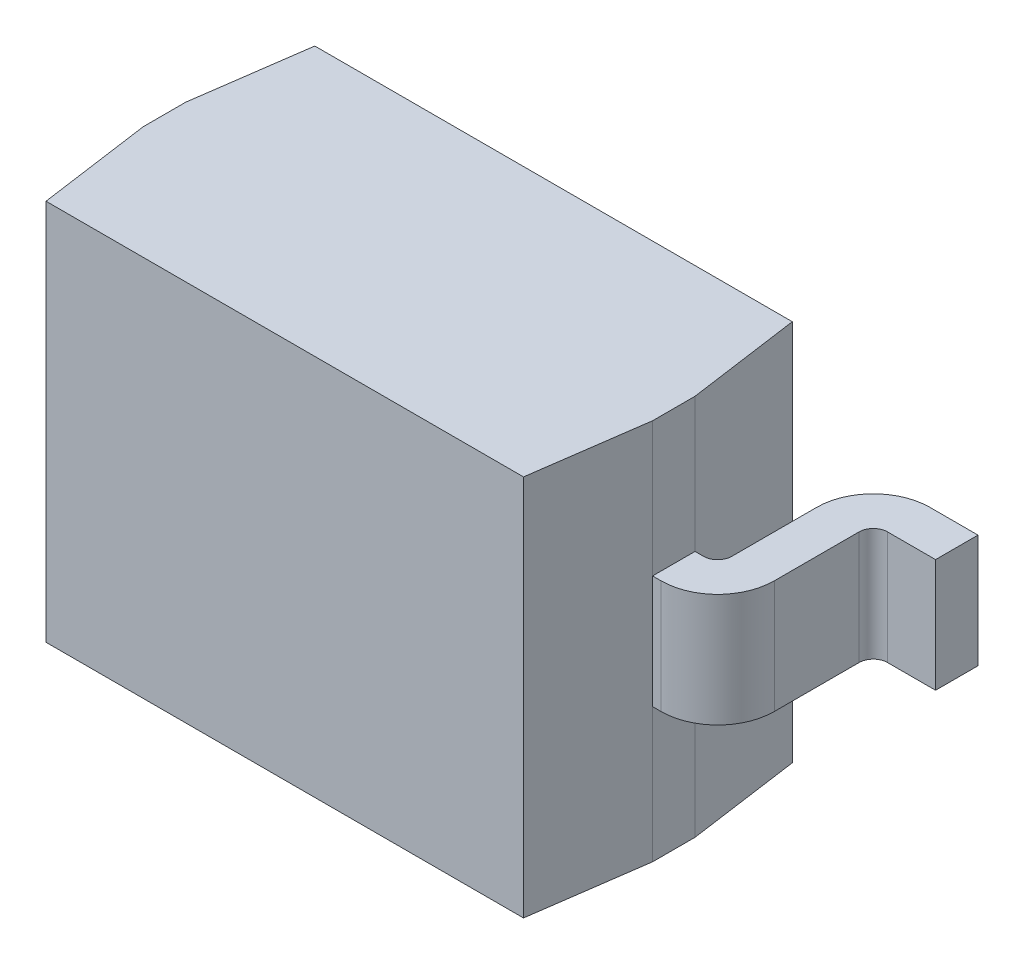
ISO-10303-21;
HEADER;
FILE_DESCRIPTION(('STEP AP214'),'2;1');
FILE_NAME('part.step','',(''),(''),'','','');
FILE_SCHEMA(('AUTOMOTIVE_DESIGN { 1 0 10303 214 1 1 1 1 }'));
ENDSEC;
DATA;
#1=APPLICATION_CONTEXT('core data for automotive mechanical design processes');
#2=APPLICATION_PROTOCOL_DEFINITION('international standard','automotive_design',2000,#1);
#3=PRODUCT_CONTEXT('',#1,'mechanical');
#4=PRODUCT('Part','Part','',(#3));
#5=PRODUCT_RELATED_PRODUCT_CATEGORY('part','',(#4));
#6=PRODUCT_DEFINITION_FORMATION('','',#4);
#7=PRODUCT_DEFINITION_CONTEXT('part definition',#1,'design');
#8=PRODUCT_DEFINITION('design','',#6,#7);
#9=PRODUCT_DEFINITION_SHAPE('','',#8);
#10=(LENGTH_UNIT() NAMED_UNIT(*) SI_UNIT(.MILLI.,.METRE.));
#11=(NAMED_UNIT(*) PLANE_ANGLE_UNIT() SI_UNIT($,.RADIAN.));
#12=(NAMED_UNIT(*) SI_UNIT($,.STERADIAN.) SOLID_ANGLE_UNIT());
#13=UNCERTAINTY_MEASURE_WITH_UNIT(LENGTH_MEASURE(1.E-05),#10,'distance_accuracy_value','');
#14=(GEOMETRIC_REPRESENTATION_CONTEXT(3) GLOBAL_UNCERTAINTY_ASSIGNED_CONTEXT((#13)) GLOBAL_UNIT_ASSIGNED_CONTEXT((#10,
#11,#12)) REPRESENTATION_CONTEXT('',''));
#15=CARTESIAN_POINT('',(0.,0.,0.));
#16=DIRECTION('',(0.,0.,1.));
#17=DIRECTION('',(1.,0.,0.));
#18=AXIS2_PLACEMENT_3D('',#15,#16,#17);
#19=CARTESIAN_POINT('',(0.871891833059522,0.,0.9));
#20=DIRECTION('',(0.99026806874157,0.,0.139173100960065));
#21=DIRECTION('',(0.,-1.,0.));
#22=AXIS2_PLACEMENT_3D('',#19,#20,#21);
#23=PLANE('',#22);
#24=DIRECTION('',(-0.139173100960065,0.,0.99026806874157));
#25=VECTOR('',#24,1.);
#26=CARTESIAN_POINT('',(0.882397998537451,0.675,0.825244748259981));
#27=LINE('',#26,#25);
#28=CARTESIAN_POINT('',(0.9,0.675,0.7));
#29=VERTEX_POINT('',#28);
#30=CARTESIAN_POINT('',(0.843783666119044,0.675,1.1));
#31=VERTEX_POINT('',#30);
#32=EDGE_CURVE('E27',#29,#31,#27,.T.);
#33=ORIENTED_EDGE('',*,*,#32,.T.);
#34=DIRECTION('',(0.,-1.,0.));
#35=VECTOR('',#34,1.);
#36=CARTESIAN_POINT('',(0.843783666119044,0.,1.1));
#37=LINE('',#36,#35);
#38=CARTESIAN_POINT('',(0.843783666119044,-0.675,1.1));
#39=VERTEX_POINT('',#38);
#40=EDGE_CURVE('E11',#31,#39,#37,.T.);
#41=ORIENTED_EDGE('',*,*,#40,.T.);
#42=DIRECTION('',(0.139173100960065,0.,-0.99026806874157));
#43=VECTOR('',#42,1.);
#44=CARTESIAN_POINT('',(0.882397998537451,-0.675,0.825244748259981));
#45=LINE('',#44,#43);
#46=CARTESIAN_POINT('',(0.9,-0.675,0.7));
#47=VERTEX_POINT('',#46);
#48=EDGE_CURVE('E509',#39,#47,#45,.T.);
#49=ORIENTED_EDGE('',*,*,#48,.T.);
#50=DIRECTION('',(0.,1.,0.));
#51=VECTOR('',#50,1.);
#52=CARTESIAN_POINT('',(0.9,0.,0.7));
#53=LINE('',#52,#51);
#54=CARTESIAN_POINT('',(0.9,-0.2,0.7));
#55=VERTEX_POINT('',#54);
#56=EDGE_CURVE('E318',#47,#55,#53,.T.);
#57=ORIENTED_EDGE('',*,*,#56,.T.);
#58=DIRECTION('',(0.,1.,0.));
#59=VECTOR('',#58,1.);
#60=CARTESIAN_POINT('',(0.9,0.,0.7));
#61=LINE('',#60,#59);
#62=CARTESIAN_POINT('',(0.9,0.2,0.7));
#63=VERTEX_POINT('',#62);
#64=EDGE_CURVE('E481',#55,#63,#61,.T.);
#65=ORIENTED_EDGE('',*,*,#64,.T.);
#66=DIRECTION('',(0.,1.,0.));
#67=VECTOR('',#66,1.);
#68=CARTESIAN_POINT('',(0.9,0.,0.7));
#69=LINE('',#68,#67);
#70=EDGE_CURVE('E307',#63,#29,#69,.T.);
#71=ORIENTED_EDGE('',*,*,#70,.T.);
#72=EDGE_LOOP('',(#33,#41,#49,#57,#65,#71));
#73=FACE_BOUND('',#72,.T.);
#74=ADVANCED_FACE('F16',(#73),#23,.T.);
#75=CARTESIAN_POINT('',(0.,0.,1.1));
#76=DIRECTION('',(0.,0.,-1.));
#77=DIRECTION('',(0.,-1.,0.));
#78=AXIS2_PLACEMENT_3D('',#75,#76,#77);
#79=PLANE('',#78);
#80=DIRECTION('',(0.,1.,0.));
#81=VECTOR('',#80,1.);
#82=CARTESIAN_POINT('',(-0.843783666119043,0.,1.1));
#83=LINE('',#82,#81);
#84=CARTESIAN_POINT('',(-0.843783666119043,-0.675,1.1));
#85=VERTEX_POINT('',#84);
#86=CARTESIAN_POINT('',(-0.843783666119043,0.675,1.1));
#87=VERTEX_POINT('',#86);
#88=EDGE_CURVE('E421',#85,#87,#83,.T.);
#89=ORIENTED_EDGE('',*,*,#88,.F.);
#90=DIRECTION('',(-1.,0.,0.));
#91=VECTOR('',#90,1.);
#92=CARTESIAN_POINT('',(0.,-0.675,1.1));
#93=LINE('',#92,#91);
#94=EDGE_CURVE('E433',#39,#85,#93,.T.);
#95=ORIENTED_EDGE('',*,*,#94,.F.);
#96=ORIENTED_EDGE('',*,*,#40,.F.);
#97=DIRECTION('',(1.,0.,0.));
#98=VECTOR('',#97,1.);
#99=CARTESIAN_POINT('',(0.,0.675,1.1));
#100=LINE('',#99,#98);
#101=EDGE_CURVE('E518',#87,#31,#100,.T.);
#102=ORIENTED_EDGE('',*,*,#101,.F.);
#103=EDGE_LOOP('',(#89,#95,#96,#102));
#104=FACE_BOUND('',#103,.T.);
#105=ADVANCED_FACE('F1050',(#104),#79,.F.);
#106=CARTESIAN_POINT('',(0.,0.675,0.625));
#107=DIRECTION('',(0.,-1.,0.));
#108=DIRECTION('',(-1.,0.,0.));
#109=AXIS2_PLACEMENT_3D('',#106,#107,#108);
#110=PLANE('',#109);
#111=DIRECTION('',(0.139173100960065,0.,-0.99026806874157));
#112=VECTOR('',#111,1.);
#113=CARTESIAN_POINT('',(-0.882397998537451,0.675,0.424755251740019));
#114=LINE('',#113,#112);
#115=CARTESIAN_POINT('',(-0.9,0.675,0.55));
#116=VERTEX_POINT('',#115);
#117=CARTESIAN_POINT('',(-0.843783666119043,0.675,0.15));
#118=VERTEX_POINT('',#117);
#119=EDGE_CURVE('E281',#116,#118,#114,.T.);
#120=ORIENTED_EDGE('',*,*,#119,.F.);
#121=DIRECTION('',(0.,0.,1.));
#122=VECTOR('',#121,1.);
#123=CARTESIAN_POINT('',(-0.9,0.675,0.625));
#124=LINE('',#123,#122);
#125=CARTESIAN_POINT('',(-0.9,0.675,0.7));
#126=VERTEX_POINT('',#125);
#127=EDGE_CURVE('E579',#116,#126,#124,.T.);
#128=ORIENTED_EDGE('',*,*,#127,.T.);
#129=DIRECTION('',(-0.139173100960065,0.,-0.99026806874157));
#130=VECTOR('',#129,1.);
#131=CARTESIAN_POINT('',(-0.882397998537451,0.675,0.825244748259981));
#132=LINE('',#131,#130);
#133=EDGE_CURVE('E418',#87,#126,#132,.T.);
#134=ORIENTED_EDGE('',*,*,#133,.F.);
#135=ORIENTED_EDGE('',*,*,#101,.T.);
#136=ORIENTED_EDGE('',*,*,#32,.F.);
#137=DIRECTION('',(0.,0.,-1.));
#138=VECTOR('',#137,1.);
#139=CARTESIAN_POINT('',(0.9,0.675,0.625));
#140=LINE('',#139,#138);
#141=CARTESIAN_POINT('',(0.9,0.675,0.55));
#142=VERTEX_POINT('',#141);
#143=EDGE_CURVE('E314',#29,#142,#140,.T.);
#144=ORIENTED_EDGE('',*,*,#143,.T.);
#145=DIRECTION('',(0.139173100960065,0.,0.99026806874157));
#146=VECTOR('',#145,1.);
#147=CARTESIAN_POINT('',(0.882397998537451,0.675,0.424755251740019));
#148=LINE('',#147,#146);
#149=CARTESIAN_POINT('',(0.843783666119044,0.675,0.15));
#150=VERTEX_POINT('',#149);
#151=EDGE_CURVE('E285',#150,#142,#148,.T.);
#152=ORIENTED_EDGE('',*,*,#151,.F.);
#153=DIRECTION('',(-1.,0.,0.));
#154=VECTOR('',#153,1.);
#155=CARTESIAN_POINT('',(0.,0.675,0.15));
#156=LINE('',#155,#154);
#157=EDGE_CURVE('E276',#150,#118,#156,.T.);
#158=ORIENTED_EDGE('',*,*,#157,.T.);
#159=EDGE_LOOP('',(#120,#128,#134,#135,#136,#144,#152,#158));
#160=FACE_BOUND('',#159,.T.);
#161=ADVANCED_FACE('F278',(#160),#110,.F.);
#162=CARTESIAN_POINT('',(-0.871891833059522,0.,0.9));
#163=DIRECTION('',(-0.99026806874157,0.,0.139173100960065));
#164=DIRECTION('',(0.,1.,0.));
#165=AXIS2_PLACEMENT_3D('',#162,#163,#164);
#166=PLANE('',#165);
#167=ORIENTED_EDGE('',*,*,#133,.T.);
#168=DIRECTION('',(0.,-1.,0.));
#169=VECTOR('',#168,1.);
#170=CARTESIAN_POINT('',(-0.9,0.,0.7));
#171=LINE('',#170,#169);
#172=CARTESIAN_POINT('',(-0.9,0.2,0.7));
#173=VERTEX_POINT('',#172);
#174=EDGE_CURVE('E576',#126,#173,#171,.T.);
#175=ORIENTED_EDGE('',*,*,#174,.T.);
#176=DIRECTION('',(0.,-1.,0.));
#177=VECTOR('',#176,1.);
#178=CARTESIAN_POINT('',(-0.9,0.,0.7));
#179=LINE('',#178,#177);
#180=CARTESIAN_POINT('',(-0.9,-0.2,0.7));
#181=VERTEX_POINT('',#180);
#182=EDGE_CURVE('E361',#173,#181,#179,.T.);
#183=ORIENTED_EDGE('',*,*,#182,.T.);
#184=DIRECTION('',(0.,-1.,0.));
#185=VECTOR('',#184,1.);
#186=CARTESIAN_POINT('',(-0.9,0.,0.7));
#187=LINE('',#186,#185);
#188=CARTESIAN_POINT('',(-0.9,-0.675,0.7));
#189=VERTEX_POINT('',#188);
#190=EDGE_CURVE('E339',#181,#189,#187,.T.);
#191=ORIENTED_EDGE('',*,*,#190,.T.);
#192=DIRECTION('',(0.139173100960065,0.,0.99026806874157));
#193=VECTOR('',#192,1.);
#194=CARTESIAN_POINT('',(-0.882397998537451,-0.675,0.825244748259982));
#195=LINE('',#194,#193);
#196=EDGE_CURVE('E290',#189,#85,#195,.T.);
#197=ORIENTED_EDGE('',*,*,#196,.T.);
#198=ORIENTED_EDGE('',*,*,#88,.T.);
#199=EDGE_LOOP('',(#167,#175,#183,#191,#197,#198));
#200=FACE_BOUND('',#199,.T.);
#201=ADVANCED_FACE('F1049',(#200),#166,.T.);
#202=CARTESIAN_POINT('',(0.871891833059522,0.,0.35));
#203=DIRECTION('',(0.99026806874157,0.,-0.139173100960065));
#204=DIRECTION('',(0.,-1.,0.));
#205=AXIS2_PLACEMENT_3D('',#202,#203,#204);
#206=PLANE('',#205);
#207=ORIENTED_EDGE('',*,*,#151,.T.);
#208=DIRECTION('',(0.,-1.,0.));
#209=VECTOR('',#208,1.);
#210=CARTESIAN_POINT('',(0.9,0.,0.55));
#211=LINE('',#210,#209);
#212=CARTESIAN_POINT('',(0.9,0.2,0.55));
#213=VERTEX_POINT('',#212);
#214=EDGE_CURVE('E438',#142,#213,#211,.T.);
#215=ORIENTED_EDGE('',*,*,#214,.T.);
#216=DIRECTION('',(0.,-1.,0.));
#217=VECTOR('',#216,1.);
#218=CARTESIAN_POINT('',(0.9,0.,0.55));
#219=LINE('',#218,#217);
#220=CARTESIAN_POINT('',(0.9,-0.2,0.55));
#221=VERTEX_POINT('',#220);
#222=EDGE_CURVE('E327',#213,#221,#219,.T.);
#223=ORIENTED_EDGE('',*,*,#222,.T.);
#224=DIRECTION('',(0.,-1.,0.));
#225=VECTOR('',#224,1.);
#226=CARTESIAN_POINT('',(0.9,0.,0.55));
#227=LINE('',#226,#225);
#228=CARTESIAN_POINT('',(0.9,-0.675,0.55));
#229=VERTEX_POINT('',#228);
#230=EDGE_CURVE('E441',#221,#229,#227,.T.);
#231=ORIENTED_EDGE('',*,*,#230,.T.);
#232=DIRECTION('',(-0.139173100960065,0.,-0.99026806874157));
#233=VECTOR('',#232,1.);
#234=CARTESIAN_POINT('',(0.882397998537451,-0.675,0.424755251740019));
#235=LINE('',#234,#233);
#236=CARTESIAN_POINT('',(0.843783666119044,-0.675,0.15));
#237=VERTEX_POINT('',#236);
#238=EDGE_CURVE('E443',#229,#237,#235,.T.);
#239=ORIENTED_EDGE('',*,*,#238,.T.);
#240=DIRECTION('',(0.,1.,0.));
#241=VECTOR('',#240,1.);
#242=CARTESIAN_POINT('',(0.843783666119044,0.,0.15));
#243=LINE('',#242,#241);
#244=EDGE_CURVE('E289',#237,#150,#243,.T.);
#245=ORIENTED_EDGE('',*,*,#244,.T.);
#246=EDGE_LOOP('',(#207,#215,#223,#231,#239,#245));
#247=FACE_BOUND('',#246,.T.);
#248=ADVANCED_FACE('F1108',(#247),#206,.T.);
#249=CARTESIAN_POINT('',(0.,0.,0.15));
#250=DIRECTION('',(0.,0.,1.));
#251=DIRECTION('',(0.,-1.,0.));
#252=AXIS2_PLACEMENT_3D('',#249,#250,#251);
#253=PLANE('',#252);
#254=DIRECTION('',(0.,-1.,0.));
#255=VECTOR('',#254,1.);
#256=CARTESIAN_POINT('',(-0.843783666119043,0.,0.15));
#257=LINE('',#256,#255);
#258=CARTESIAN_POINT('',(-0.843783666119043,-0.675,0.15));
#259=VERTEX_POINT('',#258);
#260=EDGE_CURVE('E293',#118,#259,#257,.T.);
#261=ORIENTED_EDGE('',*,*,#260,.F.);
#262=ORIENTED_EDGE('',*,*,#157,.F.);
#263=ORIENTED_EDGE('',*,*,#244,.F.);
#264=DIRECTION('',(1.,0.,0.));
#265=VECTOR('',#264,1.);
#266=CARTESIAN_POINT('',(0.,-0.675,0.15));
#267=LINE('',#266,#265);
#268=EDGE_CURVE('E296',#259,#237,#267,.T.);
#269=ORIENTED_EDGE('',*,*,#268,.F.);
#270=EDGE_LOOP('',(#261,#262,#263,#269));
#271=FACE_BOUND('',#270,.T.);
#272=ADVANCED_FACE('F294',(#271),#253,.F.);
#273=CARTESIAN_POINT('',(0.,-0.675,0.625));
#274=DIRECTION('',(0.,-1.,0.));
#275=DIRECTION('',(-1.,0.,0.));
#276=AXIS2_PLACEMENT_3D('',#273,#274,#275);
#277=PLANE('',#276);
#278=DIRECTION('',(-0.139173100960065,0.,0.99026806874157));
#279=VECTOR('',#278,1.);
#280=CARTESIAN_POINT('',(-0.882397998537451,-0.675,0.424755251740019));
#281=LINE('',#280,#279);
#282=CARTESIAN_POINT('',(-0.9,-0.675,0.55));
#283=VERTEX_POINT('',#282);
#284=EDGE_CURVE('E300',#259,#283,#281,.T.);
#285=ORIENTED_EDGE('',*,*,#284,.F.);
#286=ORIENTED_EDGE('',*,*,#268,.T.);
#287=ORIENTED_EDGE('',*,*,#238,.F.);
#288=DIRECTION('',(0.,0.,1.));
#289=VECTOR('',#288,1.);
#290=CARTESIAN_POINT('',(0.9,-0.675,0.625));
#291=LINE('',#290,#289);
#292=EDGE_CURVE('E493',#229,#47,#291,.T.);
#293=ORIENTED_EDGE('',*,*,#292,.T.);
#294=ORIENTED_EDGE('',*,*,#48,.F.);
#295=ORIENTED_EDGE('',*,*,#94,.T.);
#296=ORIENTED_EDGE('',*,*,#196,.F.);
#297=DIRECTION('',(0.,0.,-1.));
#298=VECTOR('',#297,1.);
#299=CARTESIAN_POINT('',(-0.9,-0.675,0.625));
#300=LINE('',#299,#298);
#301=EDGE_CURVE('E335',#189,#283,#300,.T.);
#302=ORIENTED_EDGE('',*,*,#301,.T.);
#303=EDGE_LOOP('',(#285,#286,#287,#293,#294,#295,#296,#302));
#304=FACE_BOUND('',#303,.T.);
#305=ADVANCED_FACE('F999',(#304),#277,.T.);
#306=CARTESIAN_POINT('',(-0.871891833059522,0.,0.35));
#307=DIRECTION('',(-0.99026806874157,0.,-0.139173100960065));
#308=DIRECTION('',(-0.139173100960065,0.,0.99026806874157));
#309=AXIS2_PLACEMENT_3D('',#306,#307,#308);
#310=PLANE('',#309);
#311=ORIENTED_EDGE('',*,*,#119,.T.);
#312=ORIENTED_EDGE('',*,*,#260,.T.);
#313=ORIENTED_EDGE('',*,*,#284,.T.);
#314=DIRECTION('',(0.,1.,0.));
#315=VECTOR('',#314,1.);
#316=CARTESIAN_POINT('',(-0.9,0.,0.55));
#317=LINE('',#316,#315);
#318=CARTESIAN_POINT('',(-0.9,-0.2,0.55));
#319=VERTEX_POINT('',#318);
#320=EDGE_CURVE('E340',#283,#319,#317,.T.);
#321=ORIENTED_EDGE('',*,*,#320,.T.);
#322=DIRECTION('',(0.,1.,0.));
#323=VECTOR('',#322,1.);
#324=CARTESIAN_POINT('',(-0.9,0.,0.55));
#325=LINE('',#324,#323);
#326=CARTESIAN_POINT('',(-0.9,0.2,0.55));
#327=VERTEX_POINT('',#326);
#328=EDGE_CURVE('E417',#319,#327,#325,.T.);
#329=ORIENTED_EDGE('',*,*,#328,.T.);
#330=DIRECTION('',(0.,1.,0.));
#331=VECTOR('',#330,1.);
#332=CARTESIAN_POINT('',(-0.9,0.,0.55));
#333=LINE('',#332,#331);
#334=EDGE_CURVE('E304',#327,#116,#333,.T.);
#335=ORIENTED_EDGE('',*,*,#334,.T.);
#336=EDGE_LOOP('',(#311,#312,#313,#321,#329,#335));
#337=FACE_BOUND('',#336,.T.);
#338=ADVANCED_FACE('F302',(#337),#310,.T.);
#339=CARTESIAN_POINT('',(0.9,0.,0.625));
#340=DIRECTION('',(-1.,0.,0.));
#341=DIRECTION('',(0.,0.,1.));
#342=AXIS2_PLACEMENT_3D('',#339,#340,#341);
#343=PLANE('',#342);
#344=DIRECTION('',(0.,0.,-1.));
#345=VECTOR('',#344,1.);
#346=CARTESIAN_POINT('',(0.9,0.2,0.6625));
#347=LINE('',#346,#345);
#348=EDGE_CURVE('E448',#63,#213,#347,.T.);
#349=ORIENTED_EDGE('',*,*,#348,.T.);
#350=ORIENTED_EDGE('',*,*,#214,.F.);
#351=ORIENTED_EDGE('',*,*,#143,.F.);
#352=ORIENTED_EDGE('',*,*,#70,.F.);
#353=EDGE_LOOP('',(#349,#350,#351,#352));
#354=FACE_BOUND('',#353,.T.);
#355=ADVANCED_FACE('F998',(#354),#343,.F.);
#356=CARTESIAN_POINT('',(0.9,0.,0.625));
#357=DIRECTION('',(-1.,0.,0.));
#358=DIRECTION('',(0.,0.,1.));
#359=AXIS2_PLACEMENT_3D('',#356,#357,#358);
#360=PLANE('',#359);
#361=DIRECTION('',(0.,0.,1.));
#362=VECTOR('',#361,1.);
#363=CARTESIAN_POINT('',(0.9,-0.2,0.6625));
#364=LINE('',#363,#362);
#365=EDGE_CURVE('E470',#221,#55,#364,.T.);
#366=ORIENTED_EDGE('',*,*,#365,.T.);
#367=ORIENTED_EDGE('',*,*,#56,.F.);
#368=ORIENTED_EDGE('',*,*,#292,.F.);
#369=ORIENTED_EDGE('',*,*,#230,.F.);
#370=EDGE_LOOP('',(#366,#367,#368,#369));
#371=FACE_BOUND('',#370,.T.);
#372=ADVANCED_FACE('F1008',(#371),#360,.F.);
#373=CARTESIAN_POINT('',(0.9,-0.2,0.7));
#374=DIRECTION('',(0.,1.,0.));
#375=DIRECTION('',(0.,0.,-1.));
#376=AXIS2_PLACEMENT_3D('',#373,#374,#375);
#377=PLANE('',#376);
#378=ORIENTED_EDGE('',*,*,#365,.F.);
#379=DIRECTION('',(1.,0.,0.));
#380=VECTOR('',#379,1.);
#381=CARTESIAN_POINT('',(0.93,-0.2,0.55));
#382=LINE('',#381,#380);
#383=CARTESIAN_POINT('',(0.93,-0.2,0.55));
#384=VERTEX_POINT('',#383);
#385=EDGE_CURVE('E325',#221,#384,#382,.T.);
#386=ORIENTED_EDGE('',*,*,#385,.T.);
#387=CARTESIAN_POINT('',(0.93,-0.2,0.5));
#388=DIRECTION('',(0.,1.,0.));
#389=DIRECTION('',(1.,0.,0.));
#390=AXIS2_PLACEMENT_3D('',#387,#388,#389);
#391=CIRCLE('',#390,0.05);
#392=CARTESIAN_POINT('',(0.98,-0.2,0.5));
#393=VERTEX_POINT('',#392);
#394=EDGE_CURVE('E453',#384,#393,#391,.T.);
#395=ORIENTED_EDGE('',*,*,#394,.T.);
#396=DIRECTION('',(0.,0.,-1.));
#397=VECTOR('',#396,1.);
#398=CARTESIAN_POINT('',(0.98,-0.2,0.2));
#399=LINE('',#398,#397);
#400=CARTESIAN_POINT('',(0.98,-0.2,0.2));
#401=VERTEX_POINT('',#400);
#402=EDGE_CURVE('E414',#393,#401,#399,.T.);
#403=ORIENTED_EDGE('',*,*,#402,.T.);
#404=CARTESIAN_POINT('',(1.18,-0.2,0.2));
#405=DIRECTION('',(0.,-1.,0.));
#406=DIRECTION('',(1.,0.,0.));
#407=AXIS2_PLACEMENT_3D('',#404,#405,#406);
#408=CIRCLE('',#407,0.2);
#409=CARTESIAN_POINT('',(1.18,-0.2,0.));
#410=VERTEX_POINT('',#409);
#411=EDGE_CURVE('E530',#401,#410,#408,.T.);
#412=ORIENTED_EDGE('',*,*,#411,.T.);
#413=DIRECTION('',(1.,0.,0.));
#414=VECTOR('',#413,1.);
#415=CARTESIAN_POINT('',(1.35,-0.2,0.));
#416=LINE('',#415,#414);
#417=CARTESIAN_POINT('',(1.35,-0.2,0.));
#418=VERTEX_POINT('',#417);
#419=EDGE_CURVE('E545',#410,#418,#416,.T.);
#420=ORIENTED_EDGE('',*,*,#419,.T.);
#421=DIRECTION('',(0.,0.,1.));
#422=VECTOR('',#421,1.);
#423=CARTESIAN_POINT('',(1.35,-0.2,0.15));
#424=LINE('',#423,#422);
#425=CARTESIAN_POINT('',(1.35,-0.2,0.15));
#426=VERTEX_POINT('',#425);
#427=EDGE_CURVE('E334',#418,#426,#424,.T.);
#428=ORIENTED_EDGE('',*,*,#427,.T.);
#429=DIRECTION('',(-1.,0.,0.));
#430=VECTOR('',#429,1.);
#431=CARTESIAN_POINT('',(1.18,-0.2,0.15));
#432=LINE('',#431,#430);
#433=CARTESIAN_POINT('',(1.18,-0.2,0.15));
#434=VERTEX_POINT('',#433);
#435=EDGE_CURVE('E320',#426,#434,#432,.T.);
#436=ORIENTED_EDGE('',*,*,#435,.T.);
#437=CARTESIAN_POINT('',(1.18,-0.2,0.2));
#438=DIRECTION('',(0.,1.,0.));
#439=DIRECTION('',(1.,0.,0.));
#440=AXIS2_PLACEMENT_3D('',#437,#438,#439);
#441=CIRCLE('',#440,0.05);
#442=CARTESIAN_POINT('',(1.13,-0.2,0.2));
#443=VERTEX_POINT('',#442);
#444=EDGE_CURVE('E434',#434,#443,#441,.T.);
#445=ORIENTED_EDGE('',*,*,#444,.T.);
#446=DIRECTION('',(0.,0.,1.));
#447=VECTOR('',#446,1.);
#448=CARTESIAN_POINT('',(1.13,-0.2,0.5));
#449=LINE('',#448,#447);
#450=CARTESIAN_POINT('',(1.13,-0.2,0.5));
#451=VERTEX_POINT('',#450);
#452=EDGE_CURVE('E502',#443,#451,#449,.T.);
#453=ORIENTED_EDGE('',*,*,#452,.T.);
#454=CARTESIAN_POINT('',(0.93,-0.2,0.5));
#455=DIRECTION('',(0.,-1.,0.));
#456=DIRECTION('',(1.,0.,0.));
#457=AXIS2_PLACEMENT_3D('',#454,#455,#456);
#458=CIRCLE('',#457,0.2);
#459=CARTESIAN_POINT('',(0.93,-0.2,0.7));
#460=VERTEX_POINT('',#459);
#461=EDGE_CURVE('E341',#451,#460,#458,.T.);
#462=ORIENTED_EDGE('',*,*,#461,.T.);
#463=DIRECTION('',(-1.,0.,0.));
#464=VECTOR('',#463,1.);
#465=CARTESIAN_POINT('',(0.9,-0.2,0.7));
#466=LINE('',#465,#464);
#467=EDGE_CURVE('E389',#460,#55,#466,.T.);
#468=ORIENTED_EDGE('',*,*,#467,.T.);
#469=EDGE_LOOP('',(#378,#386,#395,#403,#412,#420,#428,#436,#445,#453,#462,#468));
#470=FACE_BOUND('',#469,.T.);
#471=ADVANCED_FACE('F1004',(#470),#377,.F.);
#472=CARTESIAN_POINT('',(0.9,0.2,0.7));
#473=DIRECTION('',(0.,1.,0.));
#474=DIRECTION('',(0.,0.,-1.));
#475=AXIS2_PLACEMENT_3D('',#472,#473,#474);
#476=PLANE('',#475);
#477=ORIENTED_EDGE('',*,*,#348,.F.);
#478=DIRECTION('',(1.,0.,0.));
#479=VECTOR('',#478,1.);
#480=CARTESIAN_POINT('',(0.9,0.2,0.7));
#481=LINE('',#480,#479);
#482=CARTESIAN_POINT('',(0.93,0.2,0.7));
#483=VERTEX_POINT('',#482);
#484=EDGE_CURVE('E478',#63,#483,#481,.T.);
#485=ORIENTED_EDGE('',*,*,#484,.T.);
#486=CARTESIAN_POINT('',(0.93,0.2,0.5));
#487=DIRECTION('',(0.,1.,0.));
#488=DIRECTION('',(1.,0.,0.));
#489=AXIS2_PLACEMENT_3D('',#486,#487,#488);
#490=CIRCLE('',#489,0.2);
#491=CARTESIAN_POINT('',(1.13,0.2,0.5));
#492=VERTEX_POINT('',#491);
#493=EDGE_CURVE('E345',#483,#492,#490,.T.);
#494=ORIENTED_EDGE('',*,*,#493,.T.);
#495=DIRECTION('',(0.,0.,-1.));
#496=VECTOR('',#495,1.);
#497=CARTESIAN_POINT('',(1.13,0.2,0.5));
#498=LINE('',#497,#496);
#499=CARTESIAN_POINT('',(1.13,0.2,0.2));
#500=VERTEX_POINT('',#499);
#501=EDGE_CURVE('E492',#492,#500,#498,.T.);
#502=ORIENTED_EDGE('',*,*,#501,.T.);
#503=CARTESIAN_POINT('',(1.18,0.2,0.2));
#504=DIRECTION('',(0.,-1.,0.));
#505=DIRECTION('',(1.,0.,0.));
#506=AXIS2_PLACEMENT_3D('',#503,#504,#505);
#507=CIRCLE('',#506,0.05);
#508=CARTESIAN_POINT('',(1.18,0.2,0.15));
#509=VERTEX_POINT('',#508);
#510=EDGE_CURVE('E437',#500,#509,#507,.T.);
#511=ORIENTED_EDGE('',*,*,#510,.T.);
#512=DIRECTION('',(1.,0.,0.));
#513=VECTOR('',#512,1.);
#514=CARTESIAN_POINT('',(1.18,0.2,0.15));
#515=LINE('',#514,#513);
#516=CARTESIAN_POINT('',(1.35,0.2,0.15));
#517=VERTEX_POINT('',#516);
#518=EDGE_CURVE('E324',#509,#517,#515,.T.);
#519=ORIENTED_EDGE('',*,*,#518,.T.);
#520=DIRECTION('',(0.,0.,-1.));
#521=VECTOR('',#520,1.);
#522=CARTESIAN_POINT('',(1.35,0.2,0.15));
#523=LINE('',#522,#521);
#524=CARTESIAN_POINT('',(1.35,0.2,0.));
#525=VERTEX_POINT('',#524);
#526=EDGE_CURVE('E330',#517,#525,#523,.T.);
#527=ORIENTED_EDGE('',*,*,#526,.T.);
#528=DIRECTION('',(-1.,0.,0.));
#529=VECTOR('',#528,1.);
#530=CARTESIAN_POINT('',(1.35,0.2,0.));
#531=LINE('',#530,#529);
#532=CARTESIAN_POINT('',(1.18,0.2,0.));
#533=VERTEX_POINT('',#532);
#534=EDGE_CURVE('E557',#525,#533,#531,.T.);
#535=ORIENTED_EDGE('',*,*,#534,.T.);
#536=CARTESIAN_POINT('',(1.18,0.2,0.2));
#537=DIRECTION('',(0.,1.,0.));
#538=DIRECTION('',(1.,0.,0.));
#539=AXIS2_PLACEMENT_3D('',#536,#537,#538);
#540=CIRCLE('',#539,0.2);
#541=CARTESIAN_POINT('',(0.98,0.2,0.2));
#542=VERTEX_POINT('',#541);
#543=EDGE_CURVE('E534',#533,#542,#540,.T.);
#544=ORIENTED_EDGE('',*,*,#543,.T.);
#545=DIRECTION('',(0.,0.,1.));
#546=VECTOR('',#545,1.);
#547=CARTESIAN_POINT('',(0.98,0.2,0.2));
#548=LINE('',#547,#546);
#549=CARTESIAN_POINT('',(0.98,0.2,0.5));
#550=VERTEX_POINT('',#549);
#551=EDGE_CURVE('E597',#542,#550,#548,.T.);
#552=ORIENTED_EDGE('',*,*,#551,.T.);
#553=CARTESIAN_POINT('',(0.93,0.2,0.5));
#554=DIRECTION('',(0.,-1.,0.));
#555=DIRECTION('',(1.,0.,0.));
#556=AXIS2_PLACEMENT_3D('',#553,#554,#555);
#557=CIRCLE('',#556,0.05);
#558=CARTESIAN_POINT('',(0.93,0.2,0.55));
#559=VERTEX_POINT('',#558);
#560=EDGE_CURVE('E413',#550,#559,#557,.T.);
#561=ORIENTED_EDGE('',*,*,#560,.T.);
#562=DIRECTION('',(-1.,0.,0.));
#563=VECTOR('',#562,1.);
#564=CARTESIAN_POINT('',(0.93,0.2,0.55));
#565=LINE('',#564,#563);
#566=EDGE_CURVE('E328',#559,#213,#565,.T.);
#567=ORIENTED_EDGE('',*,*,#566,.T.);
#568=EDGE_LOOP('',(#477,#485,#494,#502,#511,#519,#527,#535,#544,#552,#561,#567));
#569=FACE_BOUND('',#568,.T.);
#570=ADVANCED_FACE('F970',(#569),#476,.T.);
#571=CARTESIAN_POINT('',(0.9,0.2,0.55));
#572=DIRECTION('',(0.,0.,-1.));
#573=DIRECTION('',(0.,-1.,0.));
#574=AXIS2_PLACEMENT_3D('',#571,#572,#573);
#575=PLANE('',#574);
#576=ORIENTED_EDGE('',*,*,#566,.F.);
#577=DIRECTION('',(0.,-1.,0.));
#578=VECTOR('',#577,1.);
#579=CARTESIAN_POINT('',(0.93,0.2,0.55));
#580=LINE('',#579,#578);
#581=EDGE_CURVE('E457',#559,#384,#580,.T.);
#582=ORIENTED_EDGE('',*,*,#581,.T.);
#583=ORIENTED_EDGE('',*,*,#385,.F.);
#584=ORIENTED_EDGE('',*,*,#222,.F.);
#585=EDGE_LOOP('',(#576,#582,#583,#584));
#586=FACE_BOUND('',#585,.T.);
#587=ADVANCED_FACE('F965',(#586),#575,.T.);
#588=CARTESIAN_POINT('',(0.93,0.2,0.5));
#589=DIRECTION('',(0.,-1.,0.));
#590=DIRECTION('',(1.,0.,0.));
#591=AXIS2_PLACEMENT_3D('',#588,#589,#590);
#592=CYLINDRICAL_SURFACE('',#591,0.05);
#593=ORIENTED_EDGE('',*,*,#560,.F.);
#594=DIRECTION('',(0.,-1.,0.));
#595=VECTOR('',#594,1.);
#596=CARTESIAN_POINT('',(0.98,0.2,0.5));
#597=LINE('',#596,#595);
#598=EDGE_CURVE('E409',#550,#393,#597,.T.);
#599=ORIENTED_EDGE('',*,*,#598,.T.);
#600=ORIENTED_EDGE('',*,*,#394,.F.);
#601=ORIENTED_EDGE('',*,*,#581,.F.);
#602=EDGE_LOOP('',(#593,#599,#600,#601));
#603=FACE_BOUND('',#602,.T.);
#604=ADVANCED_FACE('F969',(#603),#592,.F.);
#605=CARTESIAN_POINT('',(0.98,0.2,0.5));
#606=DIRECTION('',(-1.,0.,0.));
#607=DIRECTION('',(0.,0.,1.));
#608=AXIS2_PLACEMENT_3D('',#605,#606,#607);
#609=PLANE('',#608);
#610=ORIENTED_EDGE('',*,*,#551,.F.);
#611=DIRECTION('',(0.,-1.,0.));
#612=VECTOR('',#611,1.);
#613=CARTESIAN_POINT('',(0.98,0.2,0.2));
#614=LINE('',#613,#612);
#615=EDGE_CURVE('E533',#542,#401,#614,.T.);
#616=ORIENTED_EDGE('',*,*,#615,.T.);
#617=ORIENTED_EDGE('',*,*,#402,.F.);
#618=ORIENTED_EDGE('',*,*,#598,.F.);
#619=EDGE_LOOP('',(#610,#616,#617,#618));
#620=FACE_BOUND('',#619,.T.);
#621=ADVANCED_FACE('F1040',(#620),#609,.T.);
#622=CARTESIAN_POINT('',(1.18,0.2,0.2));
#623=DIRECTION('',(0.,-1.,0.));
#624=DIRECTION('',(1.,0.,0.));
#625=AXIS2_PLACEMENT_3D('',#622,#623,#624);
#626=CYLINDRICAL_SURFACE('',#625,0.2);
#627=ORIENTED_EDGE('',*,*,#543,.F.);
#628=DIRECTION('',(0.,-1.,0.));
#629=VECTOR('',#628,1.);
#630=CARTESIAN_POINT('',(1.18,0.2,0.));
#631=LINE('',#630,#629);
#632=EDGE_CURVE('E541',#533,#410,#631,.T.);
#633=ORIENTED_EDGE('',*,*,#632,.T.);
#634=ORIENTED_EDGE('',*,*,#411,.F.);
#635=ORIENTED_EDGE('',*,*,#615,.F.);
#636=EDGE_LOOP('',(#627,#633,#634,#635));
#637=FACE_BOUND('',#636,.T.);
#638=ADVANCED_FACE('F1035',(#637),#626,.T.);
#639=CARTESIAN_POINT('',(1.18,0.2,0.));
#640=DIRECTION('',(0.,0.,-1.));
#641=DIRECTION('',(0.,-1.,0.));
#642=AXIS2_PLACEMENT_3D('',#639,#640,#641);
#643=PLANE('',#642);
#644=ORIENTED_EDGE('',*,*,#534,.F.);
#645=DIRECTION('',(0.,-1.,0.));
#646=VECTOR('',#645,1.);
#647=CARTESIAN_POINT('',(1.35,0.2,0.));
#648=LINE('',#647,#646);
#649=EDGE_CURVE('E553',#525,#418,#648,.T.);
#650=ORIENTED_EDGE('',*,*,#649,.T.);
#651=ORIENTED_EDGE('',*,*,#419,.F.);
#652=ORIENTED_EDGE('',*,*,#632,.F.);
#653=EDGE_LOOP('',(#644,#650,#651,#652));
#654=FACE_BOUND('',#653,.T.);
#655=ADVANCED_FACE('F1039',(#654),#643,.T.);
#656=CARTESIAN_POINT('',(1.35,0.2,0.));
#657=DIRECTION('',(1.,0.,0.));
#658=DIRECTION('',(0.,1.,0.));
#659=AXIS2_PLACEMENT_3D('',#656,#657,#658);
#660=PLANE('',#659);
#661=ORIENTED_EDGE('',*,*,#526,.F.);
#662=DIRECTION('',(0.,-1.,0.));
#663=VECTOR('',#662,1.);
#664=CARTESIAN_POINT('',(1.35,0.2,0.15));
#665=LINE('',#664,#663);
#666=EDGE_CURVE('E323',#517,#426,#665,.T.);
#667=ORIENTED_EDGE('',*,*,#666,.T.);
#668=ORIENTED_EDGE('',*,*,#427,.F.);
#669=ORIENTED_EDGE('',*,*,#649,.F.);
#670=EDGE_LOOP('',(#661,#667,#668,#669));
#671=FACE_BOUND('',#670,.T.);
#672=ADVANCED_FACE('F1121',(#671),#660,.T.);
#673=CARTESIAN_POINT('',(1.35,0.2,0.15));
#674=DIRECTION('',(0.,0.,1.));
#675=DIRECTION('',(0.,-1.,0.));
#676=AXIS2_PLACEMENT_3D('',#673,#674,#675);
#677=PLANE('',#676);
#678=ORIENTED_EDGE('',*,*,#518,.F.);
#679=DIRECTION('',(0.,-1.,0.));
#680=VECTOR('',#679,1.);
#681=CARTESIAN_POINT('',(1.18,0.2,0.15));
#682=LINE('',#681,#680);
#683=EDGE_CURVE('E400',#509,#434,#682,.T.);
#684=ORIENTED_EDGE('',*,*,#683,.T.);
#685=ORIENTED_EDGE('',*,*,#435,.F.);
#686=ORIENTED_EDGE('',*,*,#666,.F.);
#687=EDGE_LOOP('',(#678,#684,#685,#686));
#688=FACE_BOUND('',#687,.T.);
#689=ADVANCED_FACE('F1019',(#688),#677,.T.);
#690=CARTESIAN_POINT('',(1.18,0.2,0.2));
#691=DIRECTION('',(0.,-1.,0.));
#692=DIRECTION('',(1.,0.,0.));
#693=AXIS2_PLACEMENT_3D('',#690,#691,#692);
#694=CYLINDRICAL_SURFACE('',#693,0.05);
#695=ORIENTED_EDGE('',*,*,#510,.F.);
#696=DIRECTION('',(0.,-1.,0.));
#697=VECTOR('',#696,1.);
#698=CARTESIAN_POINT('',(1.13,0.2,0.2));
#699=LINE('',#698,#697);
#700=EDGE_CURVE('E505',#500,#443,#699,.T.);
#701=ORIENTED_EDGE('',*,*,#700,.T.);
#702=ORIENTED_EDGE('',*,*,#444,.F.);
#703=ORIENTED_EDGE('',*,*,#683,.F.);
#704=EDGE_LOOP('',(#695,#701,#702,#703));
#705=FACE_BOUND('',#704,.T.);
#706=ADVANCED_FACE('F1014',(#705),#694,.F.);
#707=CARTESIAN_POINT('',(1.13,0.2,0.2));
#708=DIRECTION('',(1.,0.,0.));
#709=DIRECTION('',(0.,1.,0.));
#710=AXIS2_PLACEMENT_3D('',#707,#708,#709);
#711=PLANE('',#710);
#712=ORIENTED_EDGE('',*,*,#501,.F.);
#713=DIRECTION('',(0.,-1.,0.));
#714=VECTOR('',#713,1.);
#715=CARTESIAN_POINT('',(1.13,0.2,0.5));
#716=LINE('',#715,#714);
#717=EDGE_CURVE('E344',#492,#451,#716,.T.);
#718=ORIENTED_EDGE('',*,*,#717,.T.);
#719=ORIENTED_EDGE('',*,*,#452,.F.);
#720=ORIENTED_EDGE('',*,*,#700,.F.);
#721=EDGE_LOOP('',(#712,#718,#719,#720));
#722=FACE_BOUND('',#721,.T.);
#723=ADVANCED_FACE('F1018',(#722),#711,.T.);
#724=CARTESIAN_POINT('',(0.93,0.2,0.5));
#725=DIRECTION('',(0.,-1.,0.));
#726=DIRECTION('',(1.,0.,0.));
#727=AXIS2_PLACEMENT_3D('',#724,#725,#726);
#728=CYLINDRICAL_SURFACE('',#727,0.2);
#729=ORIENTED_EDGE('',*,*,#493,.F.);
#730=DIRECTION('',(0.,-1.,0.));
#731=VECTOR('',#730,1.);
#732=CARTESIAN_POINT('',(0.93,0.2,0.7));
#733=LINE('',#732,#731);
#734=EDGE_CURVE('E552',#483,#460,#733,.T.);
#735=ORIENTED_EDGE('',*,*,#734,.T.);
#736=ORIENTED_EDGE('',*,*,#461,.F.);
#737=ORIENTED_EDGE('',*,*,#717,.F.);
#738=EDGE_LOOP('',(#729,#735,#736,#737));
#739=FACE_BOUND('',#738,.T.);
#740=ADVANCED_FACE('F1075',(#739),#728,.T.);
#741=CARTESIAN_POINT('',(0.93,0.2,0.7));
#742=DIRECTION('',(0.,0.,1.));
#743=DIRECTION('',(0.,-1.,0.));
#744=AXIS2_PLACEMENT_3D('',#741,#742,#743);
#745=PLANE('',#744);
#746=ORIENTED_EDGE('',*,*,#484,.F.);
#747=ORIENTED_EDGE('',*,*,#64,.F.);
#748=ORIENTED_EDGE('',*,*,#467,.F.);
#749=ORIENTED_EDGE('',*,*,#734,.F.);
#750=EDGE_LOOP('',(#746,#747,#748,#749));
#751=FACE_BOUND('',#750,.T.);
#752=ADVANCED_FACE('F1071',(#751),#745,.T.);
#753=CARTESIAN_POINT('',(-0.9,0.,0.625));
#754=DIRECTION('',(1.,0.,0.));
#755=DIRECTION('',(0.,1.,0.));
#756=AXIS2_PLACEMENT_3D('',#753,#754,#755);
#757=PLANE('',#756);
#758=DIRECTION('',(0.,0.,-1.));
#759=VECTOR('',#758,1.);
#760=CARTESIAN_POINT('',(-0.9,-0.2,0.6625));
#761=LINE('',#760,#759);
#762=EDGE_CURVE('E20',#181,#319,#761,.T.);
#763=ORIENTED_EDGE('',*,*,#762,.T.);
#764=ORIENTED_EDGE('',*,*,#320,.F.);
#765=ORIENTED_EDGE('',*,*,#301,.F.);
#766=ORIENTED_EDGE('',*,*,#190,.F.);
#767=EDGE_LOOP('',(#763,#764,#765,#766));
#768=FACE_BOUND('',#767,.T.);
#769=ADVANCED_FACE('F960',(#768),#757,.F.);
#770=CARTESIAN_POINT('',(-0.9,0.,0.625));
#771=DIRECTION('',(1.,0.,0.));
#772=DIRECTION('',(0.,1.,0.));
#773=AXIS2_PLACEMENT_3D('',#770,#771,#772);
#774=PLANE('',#773);
#775=DIRECTION('',(0.,0.,1.));
#776=VECTOR('',#775,1.);
#777=CARTESIAN_POINT('',(-0.9,0.2,0.6625));
#778=LINE('',#777,#776);
#779=EDGE_CURVE('E580',#327,#173,#778,.T.);
#780=ORIENTED_EDGE('',*,*,#779,.T.);
#781=ORIENTED_EDGE('',*,*,#174,.F.);
#782=ORIENTED_EDGE('',*,*,#127,.F.);
#783=ORIENTED_EDGE('',*,*,#334,.F.);
#784=EDGE_LOOP('',(#780,#781,#782,#783));
#785=FACE_BOUND('',#784,.T.);
#786=ADVANCED_FACE('F955',(#785),#774,.F.);
#787=CARTESIAN_POINT('',(-0.9,0.2,0.7));
#788=DIRECTION('',(0.,-1.,0.));
#789=DIRECTION('',(0.,0.,-1.));
#790=AXIS2_PLACEMENT_3D('',#787,#788,#789);
#791=PLANE('',#790);
#792=ORIENTED_EDGE('',*,*,#779,.F.);
#793=DIRECTION('',(-1.,0.,0.));
#794=VECTOR('',#793,1.);
#795=CARTESIAN_POINT('',(-0.93,0.2,0.55));
#796=LINE('',#795,#794);
#797=CARTESIAN_POINT('',(-0.93,0.2,0.55));
#798=VERTEX_POINT('',#797);
#799=EDGE_CURVE('E376',#327,#798,#796,.T.);
#800=ORIENTED_EDGE('',*,*,#799,.T.);
#801=CARTESIAN_POINT('',(-0.93,0.2,0.5));
#802=DIRECTION('',(0.,-1.,0.));
#803=DIRECTION('',(-1.,0.,0.));
#804=AXIS2_PLACEMENT_3D('',#801,#802,#803);
#805=CIRCLE('',#804,0.05);
#806=CARTESIAN_POINT('',(-0.98,0.2,0.5));
#807=VERTEX_POINT('',#806);
#808=EDGE_CURVE('E366',#798,#807,#805,.T.);
#809=ORIENTED_EDGE('',*,*,#808,.T.);
#810=DIRECTION('',(0.,0.,-1.));
#811=VECTOR('',#810,1.);
#812=CARTESIAN_POINT('',(-0.98,0.2,0.2));
#813=LINE('',#812,#811);
#814=CARTESIAN_POINT('',(-0.98,0.2,0.2));
#815=VERTEX_POINT('',#814);
#816=EDGE_CURVE('E351',#807,#815,#813,.T.);
#817=ORIENTED_EDGE('',*,*,#816,.T.);
#818=CARTESIAN_POINT('',(-1.18,0.2,0.2));
#819=DIRECTION('',(0.,1.,0.));
#820=DIRECTION('',(-1.,0.,0.));
#821=AXIS2_PLACEMENT_3D('',#818,#819,#820);
#822=CIRCLE('',#821,0.2);
#823=CARTESIAN_POINT('',(-1.18,0.2,0.));
#824=VERTEX_POINT('',#823);
#825=EDGE_CURVE('E466',#815,#824,#822,.T.);
#826=ORIENTED_EDGE('',*,*,#825,.T.);
#827=DIRECTION('',(-1.,0.,0.));
#828=VECTOR('',#827,1.);
#829=CARTESIAN_POINT('',(-1.35,0.2,0.));
#830=LINE('',#829,#828);
#831=CARTESIAN_POINT('',(-1.35,0.2,0.));
#832=VERTEX_POINT('',#831);
#833=EDGE_CURVE('E346',#824,#832,#830,.T.);
#834=ORIENTED_EDGE('',*,*,#833,.T.);
#835=DIRECTION('',(0.,0.,1.));
#836=VECTOR('',#835,1.);
#837=CARTESIAN_POINT('',(-1.35,0.2,0.15));
#838=LINE('',#837,#836);
#839=CARTESIAN_POINT('',(-1.35,0.2,0.15));
#840=VERTEX_POINT('',#839);
#841=EDGE_CURVE('E501',#832,#840,#838,.T.);
#842=ORIENTED_EDGE('',*,*,#841,.T.);
#843=DIRECTION('',(1.,0.,0.));
#844=VECTOR('',#843,1.);
#845=CARTESIAN_POINT('',(-1.18,0.2,0.15));
#846=LINE('',#845,#844);
#847=CARTESIAN_POINT('',(-1.18,0.2,0.15));
#848=VERTEX_POINT('',#847);
#849=EDGE_CURVE('E452',#840,#848,#846,.T.);
#850=ORIENTED_EDGE('',*,*,#849,.T.);
#851=CARTESIAN_POINT('',(-1.18,0.2,0.2));
#852=DIRECTION('',(0.,-1.,0.));
#853=DIRECTION('',(-1.,0.,0.));
#854=AXIS2_PLACEMENT_3D('',#851,#852,#853);
#855=CIRCLE('',#854,0.05);
#856=CARTESIAN_POINT('',(-1.13,0.2,0.2));
#857=VERTEX_POINT('',#856);
#858=EDGE_CURVE('E396',#848,#857,#855,.T.);
#859=ORIENTED_EDGE('',*,*,#858,.T.);
#860=DIRECTION('',(0.,0.,1.));
#861=VECTOR('',#860,1.);
#862=CARTESIAN_POINT('',(-1.13,0.2,0.5));
#863=LINE('',#862,#861);
#864=CARTESIAN_POINT('',(-1.13,0.2,0.5));
#865=VERTEX_POINT('',#864);
#866=EDGE_CURVE('E422',#857,#865,#863,.T.);
#867=ORIENTED_EDGE('',*,*,#866,.T.);
#868=CARTESIAN_POINT('',(-0.93,0.2,0.5));
#869=DIRECTION('',(0.,1.,0.));
#870=DIRECTION('',(-1.,0.,0.));
#871=AXIS2_PLACEMENT_3D('',#868,#869,#870);
#872=CIRCLE('',#871,0.2);
#873=CARTESIAN_POINT('',(-0.93,0.2,0.7));
#874=VERTEX_POINT('',#873);
#875=EDGE_CURVE('E593',#865,#874,#872,.T.);
#876=ORIENTED_EDGE('',*,*,#875,.T.);
#877=DIRECTION('',(1.,0.,0.));
#878=VECTOR('',#877,1.);
#879=CARTESIAN_POINT('',(-0.9,0.2,0.7));
#880=LINE('',#879,#878);
#881=EDGE_CURVE('E357',#874,#173,#880,.T.);
#882=ORIENTED_EDGE('',*,*,#881,.T.);
#883=EDGE_LOOP('',(#792,#800,#809,#817,#826,#834,#842,#850,#859,#867,#876,#882));
#884=FACE_BOUND('',#883,.T.);
#885=ADVANCED_FACE('F959',(#884),#791,.F.);
#886=CARTESIAN_POINT('',(-0.9,-0.2,0.7));
#887=DIRECTION('',(0.,-1.,0.));
#888=DIRECTION('',(0.,0.,-1.));
#889=AXIS2_PLACEMENT_3D('',#886,#887,#888);
#890=PLANE('',#889);
#891=ORIENTED_EDGE('',*,*,#762,.F.);
#892=DIRECTION('',(-1.,0.,0.));
#893=VECTOR('',#892,1.);
#894=CARTESIAN_POINT('',(-0.9,-0.2,0.7));
#895=LINE('',#894,#893);
#896=CARTESIAN_POINT('',(-0.93,-0.2,0.7));
#897=VERTEX_POINT('',#896);
#898=EDGE_CURVE('E474',#181,#897,#895,.T.);
#899=ORIENTED_EDGE('',*,*,#898,.T.);
#900=CARTESIAN_POINT('',(-0.93,-0.2,0.5));
#901=DIRECTION('',(0.,-1.,0.));
#902=DIRECTION('',(-1.,0.,0.));
#903=AXIS2_PLACEMENT_3D('',#900,#901,#902);
#904=CIRCLE('',#903,0.2);
#905=CARTESIAN_POINT('',(-1.13,-0.2,0.5));
#906=VERTEX_POINT('',#905);
#907=EDGE_CURVE('E538',#897,#906,#904,.T.);
#908=ORIENTED_EDGE('',*,*,#907,.T.);
#909=DIRECTION('',(0.,0.,-1.));
#910=VECTOR('',#909,1.);
#911=CARTESIAN_POINT('',(-1.13,-0.2,0.5));
#912=LINE('',#911,#910);
#913=CARTESIAN_POINT('',(-1.13,-0.2,0.2));
#914=VERTEX_POINT('',#913);
#915=EDGE_CURVE('E426',#906,#914,#912,.T.);
#916=ORIENTED_EDGE('',*,*,#915,.T.);
#917=CARTESIAN_POINT('',(-1.18,-0.2,0.2));
#918=DIRECTION('',(0.,1.,0.));
#919=DIRECTION('',(-1.,0.,0.));
#920=AXIS2_PLACEMENT_3D('',#917,#918,#919);
#921=CIRCLE('',#920,0.05);
#922=CARTESIAN_POINT('',(-1.18,-0.2,0.15));
#923=VERTEX_POINT('',#922);
#924=EDGE_CURVE('E403',#914,#923,#921,.T.);
#925=ORIENTED_EDGE('',*,*,#924,.T.);
#926=DIRECTION('',(-1.,0.,0.));
#927=VECTOR('',#926,1.);
#928=CARTESIAN_POINT('',(-1.18,-0.2,0.15));
#929=LINE('',#928,#927);
#930=CARTESIAN_POINT('',(-1.35,-0.2,0.15));
#931=VERTEX_POINT('',#930);
#932=EDGE_CURVE('E395',#923,#931,#929,.T.);
#933=ORIENTED_EDGE('',*,*,#932,.T.);
#934=DIRECTION('',(0.,0.,-1.));
#935=VECTOR('',#934,1.);
#936=CARTESIAN_POINT('',(-1.35,-0.2,0.15));
#937=LINE('',#936,#935);
#938=CARTESIAN_POINT('',(-1.35,-0.2,0.));
#939=VERTEX_POINT('',#938);
#940=EDGE_CURVE('E565',#931,#939,#937,.T.);
#941=ORIENTED_EDGE('',*,*,#940,.T.);
#942=DIRECTION('',(1.,0.,0.));
#943=VECTOR('',#942,1.);
#944=CARTESIAN_POINT('',(-1.35,-0.2,0.));
#945=LINE('',#944,#943);
#946=CARTESIAN_POINT('',(-1.18,-0.2,0.));
#947=VERTEX_POINT('',#946);
#948=EDGE_CURVE('E350',#939,#947,#945,.T.);
#949=ORIENTED_EDGE('',*,*,#948,.T.);
#950=CARTESIAN_POINT('',(-1.18,-0.2,0.2));
#951=DIRECTION('',(0.,-1.,0.));
#952=DIRECTION('',(-1.,0.,0.));
#953=AXIS2_PLACEMENT_3D('',#950,#951,#952);
#954=CIRCLE('',#953,0.2);
#955=CARTESIAN_POINT('',(-0.98,-0.2,0.2));
#956=VERTEX_POINT('',#955);
#957=EDGE_CURVE('E488',#947,#956,#954,.T.);
#958=ORIENTED_EDGE('',*,*,#957,.T.);
#959=DIRECTION('',(0.,0.,1.));
#960=VECTOR('',#959,1.);
#961=CARTESIAN_POINT('',(-0.98,-0.2,0.2));
#962=LINE('',#961,#960);
#963=CARTESIAN_POINT('',(-0.98,-0.2,0.5));
#964=VERTEX_POINT('',#963);
#965=EDGE_CURVE('E356',#956,#964,#962,.T.);
#966=ORIENTED_EDGE('',*,*,#965,.T.);
#967=CARTESIAN_POINT('',(-0.93,-0.2,0.5));
#968=DIRECTION('',(0.,1.,0.));
#969=DIRECTION('',(-1.,0.,0.));
#970=AXIS2_PLACEMENT_3D('',#967,#968,#969);
#971=CIRCLE('',#970,0.05);
#972=CARTESIAN_POINT('',(-0.93,-0.2,0.55));
#973=VERTEX_POINT('',#972);
#974=EDGE_CURVE('E378',#964,#973,#971,.T.);
#975=ORIENTED_EDGE('',*,*,#974,.T.);
#976=DIRECTION('',(1.,0.,0.));
#977=VECTOR('',#976,1.);
#978=CARTESIAN_POINT('',(-0.93,-0.2,0.55));
#979=LINE('',#978,#977);
#980=EDGE_CURVE('E365',#973,#319,#979,.T.);
#981=ORIENTED_EDGE('',*,*,#980,.T.);
#982=EDGE_LOOP('',(#891,#899,#908,#916,#925,#933,#941,#949,#958,#966,#975,#981));
#983=FACE_BOUND('',#982,.T.);
#984=ADVANCED_FACE('F1166',(#983),#890,.T.);
#985=CARTESIAN_POINT('',(-0.9,-0.2,0.55));
#986=DIRECTION('',(0.,0.,-1.));
#987=DIRECTION('',(0.,-1.,0.));
#988=AXIS2_PLACEMENT_3D('',#985,#986,#987);
#989=PLANE('',#988);
#990=ORIENTED_EDGE('',*,*,#980,.F.);
#991=DIRECTION('',(0.,1.,0.));
#992=VECTOR('',#991,1.);
#993=CARTESIAN_POINT('',(-0.93,-0.2,0.55));
#994=LINE('',#993,#992);
#995=EDGE_CURVE('E362',#973,#798,#994,.T.);
#996=ORIENTED_EDGE('',*,*,#995,.T.);
#997=ORIENTED_EDGE('',*,*,#799,.F.);
#998=ORIENTED_EDGE('',*,*,#328,.F.);
#999=EDGE_LOOP('',(#990,#996,#997,#998));
#1000=FACE_BOUND('',#999,.T.);
#1001=ADVANCED_FACE('F1182',(#1000),#989,.T.);
#1002=CARTESIAN_POINT('',(-0.93,-0.2,0.5));
#1003=DIRECTION('',(0.,1.,0.));
#1004=DIRECTION('',(-1.,0.,0.));
#1005=AXIS2_PLACEMENT_3D('',#1002,#1003,#1004);
#1006=CYLINDRICAL_SURFACE('',#1005,0.05);
#1007=ORIENTED_EDGE('',*,*,#974,.F.);
#1008=DIRECTION('',(0.,1.,0.));
#1009=VECTOR('',#1008,1.);
#1010=CARTESIAN_POINT('',(-0.98,-0.2,0.5));
#1011=LINE('',#1010,#1009);
#1012=EDGE_CURVE('E355',#964,#807,#1011,.T.);
#1013=ORIENTED_EDGE('',*,*,#1012,.T.);
#1014=ORIENTED_EDGE('',*,*,#808,.F.);
#1015=ORIENTED_EDGE('',*,*,#995,.F.);
#1016=EDGE_LOOP('',(#1007,#1013,#1014,#1015));
#1017=FACE_BOUND('',#1016,.T.);
#1018=ADVANCED_FACE('F1204',(#1017),#1006,.F.);
#1019=CARTESIAN_POINT('',(-0.98,-0.2,0.5));
#1020=DIRECTION('',(1.,0.,0.));
#1021=DIRECTION('',(0.,1.,0.));
#1022=AXIS2_PLACEMENT_3D('',#1019,#1020,#1021);
#1023=PLANE('',#1022);
#1024=ORIENTED_EDGE('',*,*,#965,.F.);
#1025=DIRECTION('',(0.,1.,0.));
#1026=VECTOR('',#1025,1.);
#1027=CARTESIAN_POINT('',(-0.98,-0.2,0.2));
#1028=LINE('',#1027,#1026);
#1029=EDGE_CURVE('E462',#956,#815,#1028,.T.);
#1030=ORIENTED_EDGE('',*,*,#1029,.T.);
#1031=ORIENTED_EDGE('',*,*,#816,.F.);
#1032=ORIENTED_EDGE('',*,*,#1012,.F.);
#1033=EDGE_LOOP('',(#1024,#1030,#1031,#1032));
#1034=FACE_BOUND('',#1033,.T.);
#1035=ADVANCED_FACE('F1141',(#1034),#1023,.T.);
#1036=CARTESIAN_POINT('',(-1.18,-0.2,0.2));
#1037=DIRECTION('',(0.,1.,0.));
#1038=DIRECTION('',(-1.,0.,0.));
#1039=AXIS2_PLACEMENT_3D('',#1036,#1037,#1038);
#1040=CYLINDRICAL_SURFACE('',#1039,0.2);
#1041=ORIENTED_EDGE('',*,*,#957,.F.);
#1042=DIRECTION('',(0.,1.,0.));
#1043=VECTOR('',#1042,1.);
#1044=CARTESIAN_POINT('',(-1.18,-0.2,0.));
#1045=LINE('',#1044,#1043);
#1046=EDGE_CURVE('E349',#947,#824,#1045,.T.);
#1047=ORIENTED_EDGE('',*,*,#1046,.T.);
#1048=ORIENTED_EDGE('',*,*,#825,.F.);
#1049=ORIENTED_EDGE('',*,*,#1029,.F.);
#1050=EDGE_LOOP('',(#1041,#1047,#1048,#1049));
#1051=FACE_BOUND('',#1050,.T.);
#1052=ADVANCED_FACE('F949',(#1051),#1040,.T.);
#1053=CARTESIAN_POINT('',(-1.18,-0.2,0.));
#1054=DIRECTION('',(0.,0.,-1.));
#1055=DIRECTION('',(0.,-1.,0.));
#1056=AXIS2_PLACEMENT_3D('',#1053,#1054,#1055);
#1057=PLANE('',#1056);
#1058=ORIENTED_EDGE('',*,*,#948,.F.);
#1059=DIRECTION('',(0.,1.,0.));
#1060=VECTOR('',#1059,1.);
#1061=CARTESIAN_POINT('',(-1.35,-0.2,0.));
#1062=LINE('',#1061,#1060);
#1063=EDGE_CURVE('E497',#939,#832,#1062,.T.);
#1064=ORIENTED_EDGE('',*,*,#1063,.T.);
#1065=ORIENTED_EDGE('',*,*,#833,.F.);
#1066=ORIENTED_EDGE('',*,*,#1046,.F.);
#1067=EDGE_LOOP('',(#1058,#1064,#1065,#1066));
#1068=FACE_BOUND('',#1067,.T.);
#1069=ADVANCED_FACE('F18',(#1068),#1057,.T.);
#1070=CARTESIAN_POINT('',(-1.35,-0.2,0.));
#1071=DIRECTION('',(-1.,0.,0.));
#1072=DIRECTION('',(0.,1.,0.));
#1073=AXIS2_PLACEMENT_3D('',#1070,#1071,#1072);
#1074=PLANE('',#1073);
#1075=ORIENTED_EDGE('',*,*,#940,.F.);
#1076=DIRECTION('',(0.,1.,0.));
#1077=VECTOR('',#1076,1.);
#1078=CARTESIAN_POINT('',(-1.35,-0.2,0.15));
#1079=LINE('',#1078,#1077);
#1080=EDGE_CURVE('E561',#931,#840,#1079,.T.);
#1081=ORIENTED_EDGE('',*,*,#1080,.T.);
#1082=ORIENTED_EDGE('',*,*,#841,.F.);
#1083=ORIENTED_EDGE('',*,*,#1063,.F.);
#1084=EDGE_LOOP('',(#1075,#1081,#1082,#1083));
#1085=FACE_BOUND('',#1084,.T.);
#1086=ADVANCED_FACE('F948',(#1085),#1074,.T.);
#1087=CARTESIAN_POINT('',(-1.35,-0.2,0.15));
#1088=DIRECTION('',(0.,0.,1.));
#1089=DIRECTION('',(0.,-1.,0.));
#1090=AXIS2_PLACEMENT_3D('',#1087,#1088,#1089);
#1091=PLANE('',#1090);
#1092=ORIENTED_EDGE('',*,*,#932,.F.);
#1093=DIRECTION('',(0.,1.,0.));
#1094=VECTOR('',#1093,1.);
#1095=CARTESIAN_POINT('',(-1.18,-0.2,0.15));
#1096=LINE('',#1095,#1094);
#1097=EDGE_CURVE('E391',#923,#848,#1096,.T.);
#1098=ORIENTED_EDGE('',*,*,#1097,.T.);
#1099=ORIENTED_EDGE('',*,*,#849,.F.);
#1100=ORIENTED_EDGE('',*,*,#1080,.F.);
#1101=EDGE_LOOP('',(#1092,#1098,#1099,#1100));
#1102=FACE_BOUND('',#1101,.T.);
#1103=ADVANCED_FACE('F976',(#1102),#1091,.T.);
#1104=CARTESIAN_POINT('',(-1.18,-0.2,0.2));
#1105=DIRECTION('',(0.,1.,0.));
#1106=DIRECTION('',(-1.,0.,0.));
#1107=AXIS2_PLACEMENT_3D('',#1104,#1105,#1106);
#1108=CYLINDRICAL_SURFACE('',#1107,0.05);
#1109=ORIENTED_EDGE('',*,*,#924,.F.);
#1110=DIRECTION('',(0.,1.,0.));
#1111=VECTOR('',#1110,1.);
#1112=CARTESIAN_POINT('',(-1.13,-0.2,0.2));
#1113=LINE('',#1112,#1111);
#1114=EDGE_CURVE('E425',#914,#857,#1113,.T.);
#1115=ORIENTED_EDGE('',*,*,#1114,.T.);
#1116=ORIENTED_EDGE('',*,*,#858,.F.);
#1117=ORIENTED_EDGE('',*,*,#1097,.F.);
#1118=EDGE_LOOP('',(#1109,#1115,#1116,#1117));
#1119=FACE_BOUND('',#1118,.T.);
#1120=ADVANCED_FACE('F980',(#1119),#1108,.F.);
#1121=CARTESIAN_POINT('',(-1.13,-0.2,0.2));
#1122=DIRECTION('',(-1.,0.,0.));
#1123=DIRECTION('',(0.,1.,0.));
#1124=AXIS2_PLACEMENT_3D('',#1121,#1122,#1123);
#1125=PLANE('',#1124);
#1126=ORIENTED_EDGE('',*,*,#915,.F.);
#1127=DIRECTION('',(0.,1.,0.));
#1128=VECTOR('',#1127,1.);
#1129=CARTESIAN_POINT('',(-1.13,-0.2,0.5));
#1130=LINE('',#1129,#1128);
#1131=EDGE_CURVE('E613',#906,#865,#1130,.T.);
#1132=ORIENTED_EDGE('',*,*,#1131,.T.);
#1133=ORIENTED_EDGE('',*,*,#866,.F.);
#1134=ORIENTED_EDGE('',*,*,#1114,.F.);
#1135=EDGE_LOOP('',(#1126,#1132,#1133,#1134));
#1136=FACE_BOUND('',#1135,.T.);
#1137=ADVANCED_FACE('F989',(#1136),#1125,.T.);
#1138=CARTESIAN_POINT('',(-0.93,-0.2,0.5));
#1139=DIRECTION('',(0.,1.,0.));
#1140=DIRECTION('',(-1.,0.,0.));
#1141=AXIS2_PLACEMENT_3D('',#1138,#1139,#1140);
#1142=CYLINDRICAL_SURFACE('',#1141,0.2);
#1143=ORIENTED_EDGE('',*,*,#907,.F.);
#1144=DIRECTION('',(0.,1.,0.));
#1145=VECTOR('',#1144,1.);
#1146=CARTESIAN_POINT('',(-0.93,-0.2,0.7));
#1147=LINE('',#1146,#1145);
#1148=EDGE_CURVE('E360',#897,#874,#1147,.T.);
#1149=ORIENTED_EDGE('',*,*,#1148,.T.);
#1150=ORIENTED_EDGE('',*,*,#875,.F.);
#1151=ORIENTED_EDGE('',*,*,#1131,.F.);
#1152=EDGE_LOOP('',(#1143,#1149,#1150,#1151));
#1153=FACE_BOUND('',#1152,.T.);
#1154=ADVANCED_FACE('F1029',(#1153),#1142,.T.);
#1155=CARTESIAN_POINT('',(-0.93,-0.2,0.7));
#1156=DIRECTION('',(0.,0.,1.));
#1157=DIRECTION('',(0.,-1.,0.));
#1158=AXIS2_PLACEMENT_3D('',#1155,#1156,#1157);
#1159=PLANE('',#1158);
#1160=ORIENTED_EDGE('',*,*,#898,.F.);
#1161=ORIENTED_EDGE('',*,*,#182,.F.);
#1162=ORIENTED_EDGE('',*,*,#881,.F.);
#1163=ORIENTED_EDGE('',*,*,#1148,.F.);
#1164=EDGE_LOOP('',(#1160,#1161,#1162,#1163));
#1165=FACE_BOUND('',#1164,.T.);
#1166=ADVANCED_FACE('F1025',(#1165),#1159,.T.);
#1167=CLOSED_SHELL('',(#74,#105,#161,#201,#248,#272,#305,#338,#355,#372,#471,#570,#587,#604,
#621,#638,#655,#672,#689,#706,#723,#740,#752,#769,#786,#885,#984,#1001,#1018,#1035,#1052,#1069,
#1086,#1103,#1120,#1137,#1154,#1166));
#1168=MANIFOLD_SOLID_BREP('B1',#1167);
#1169=ADVANCED_BREP_SHAPE_REPRESENTATION('',(#18,#1168),#14);
#1170=SHAPE_DEFINITION_REPRESENTATION(#9,#1169);
ENDSEC;
END-ISO-10303-21;
